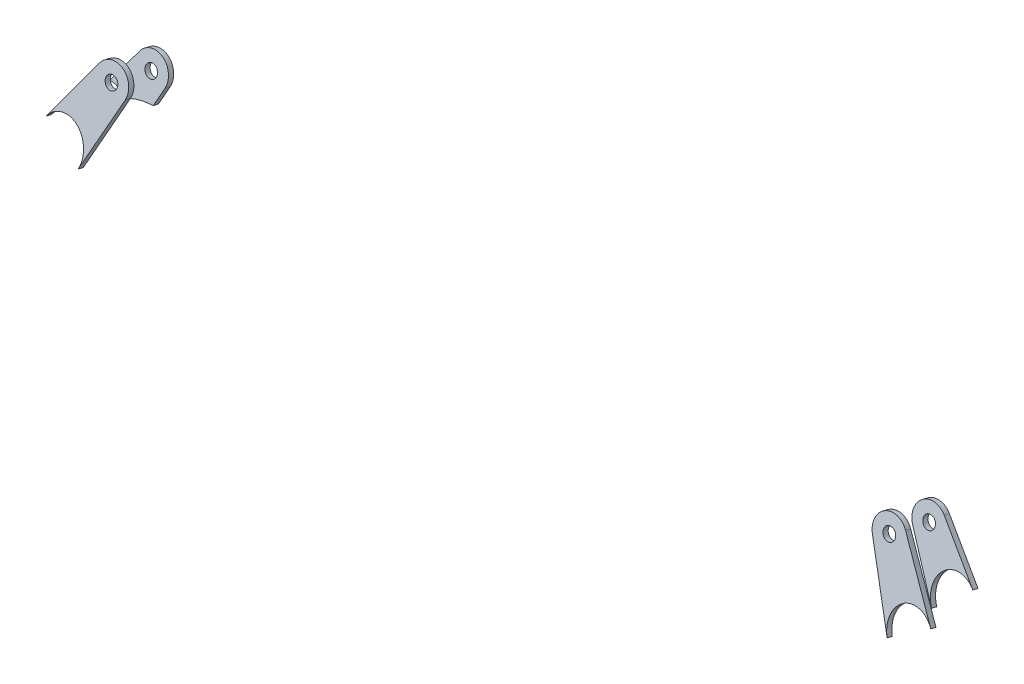
ISO-10303-21;
HEADER;
FILE_DESCRIPTION(('STEP AP214'),'2;1');
FILE_NAME('part.step','',(''),(''),'','','');
FILE_SCHEMA(('AUTOMOTIVE_DESIGN { 1 0 10303 214 1 1 1 1 }'));
ENDSEC;
DATA;
#1=APPLICATION_CONTEXT('core data for automotive mechanical design processes');
#2=APPLICATION_PROTOCOL_DEFINITION('international standard','automotive_design',2000,#1);
#3=PRODUCT_CONTEXT('',#1,'mechanical');
#4=PRODUCT('Part','Part','',(#3));
#5=PRODUCT_RELATED_PRODUCT_CATEGORY('part','',(#4));
#6=PRODUCT_DEFINITION_FORMATION('','',#4);
#7=PRODUCT_DEFINITION_CONTEXT('part definition',#1,'design');
#8=PRODUCT_DEFINITION('design','',#6,#7);
#9=PRODUCT_DEFINITION_SHAPE('','',#8);
#10=(LENGTH_UNIT() NAMED_UNIT(*) SI_UNIT(.MILLI.,.METRE.));
#11=(NAMED_UNIT(*) PLANE_ANGLE_UNIT() SI_UNIT($,.RADIAN.));
#12=(NAMED_UNIT(*) SI_UNIT($,.STERADIAN.) SOLID_ANGLE_UNIT());
#13=UNCERTAINTY_MEASURE_WITH_UNIT(LENGTH_MEASURE(1.E-05),#10,'distance_accuracy_value','');
#14=(GEOMETRIC_REPRESENTATION_CONTEXT(3) GLOBAL_UNCERTAINTY_ASSIGNED_CONTEXT((#13)) GLOBAL_UNIT_ASSIGNED_CONTEXT((#10,
#11,#12)) REPRESENTATION_CONTEXT('',''));
#15=CARTESIAN_POINT('',(0.,0.,0.));
#16=DIRECTION('',(0.,0.,1.));
#17=DIRECTION('',(1.,0.,0.));
#18=AXIS2_PLACEMENT_3D('',#15,#16,#17);
#19=CARTESIAN_POINT('',(276.400172342298,125.62511904744,-250.915447619186));
#20=DIRECTION('',(0.835441108676598,0.534681813865597,-0.127096466727488));
#21=DIRECTION('',(-0.539053341897115,0.842271627558208,0.));
#22=AXIS2_PLACEMENT_3D('',#19,#20,#21);
#23=PLANE('',#22);
#24=DIRECTION('',(-0.54956965034393,0.811360603043202,-0.19916619002788));
#25=VECTOR('',#24,1.);
#26=CARTESIAN_POINT('',(276.410280763866,124.916399097279,-253.830514316889));
#27=LINE('',#26,#25);
#28=CARTESIAN_POINT('',(210.174873139271,222.703458916671,-277.834485011557));
#29=VERTEX_POINT('',#28);
#30=CARTESIAN_POINT('',(187.902995793864,255.584684840564,-285.90590044157));
#31=VERTEX_POINT('',#30);
#32=EDGE_CURVE('E130',#29,#31,#27,.T.);
#33=ORIENTED_EDGE('',*,*,#32,.T.);
#34=DIRECTION('',(0.00336947385613183,-0.236239983387161,-0.9716888992343));
#35=VECTOR('',#34,1.);
#36=CARTESIAN_POINT('',(187.892887372296,256.293404790725,-282.990833743867));
#37=LINE('',#36,#35);
#38=CARTESIAN_POINT('',(187.892887372296,256.293404790725,-282.990833743867));
#39=VERTEX_POINT('',#38);
#40=EDGE_CURVE('E131',#39,#31,#37,.T.);
#41=ORIENTED_EDGE('',*,*,#40,.F.);
#42=DIRECTION('',(-0.54956965034393,0.811360603043202,-0.19916619002788));
#43=VECTOR('',#42,1.);
#44=CARTESIAN_POINT('',(276.400172342298,125.62511904744,-250.915447619186));
#45=LINE('',#44,#43);
#46=CARTESIAN_POINT('',(210.164764717702,223.412178866832,-274.919418313854));
#47=VERTEX_POINT('',#46);
#48=EDGE_CURVE('E108',#47,#39,#45,.T.);
#49=ORIENTED_EDGE('',*,*,#48,.F.);
#50=DIRECTION('',(0.00336947385613183,-0.236239983387161,-0.9716888992343));
#51=VECTOR('',#50,1.);
#52=CARTESIAN_POINT('',(210.164764717702,223.412178866832,-274.919418313854));
#53=LINE('',#52,#51);
#54=EDGE_CURVE('E12',#47,#29,#53,.T.);
#55=ORIENTED_EDGE('',*,*,#54,.T.);
#56=EDGE_LOOP('',(#33,#41,#49,#55));
#57=FACE_BOUND('',#56,.T.);
#58=ADVANCED_FACE('F50',(#57),#23,.T.);
#59=CARTESIAN_POINT('',(199.892236479848,228.936466831874,-276.298121634924));
#60=CARTESIAN_POINT('',(174.893160796666,228.724378984754,-276.333246151102));
#61=CARTESIAN_POINT('',(175.108137508272,202.321573672781,-269.913369736336));
#62=CARTESIAN_POINT('',(200.107213191454,202.533661519902,-269.878245220158));
#63=CARTESIAN_POINT('',(225.106288874636,202.745749367022,-269.843120703979));
#64=CARTESIAN_POINT('',(224.89131216303,229.148554678995,-276.262997118745));
#65=CARTESIAN_POINT('',(199.892236479848,228.936466831874,-276.298121634924));
#66=(BOUNDED_CURVE() B_SPLINE_CURVE(3,(#59,#60,#61,#62,#63,#64,#65),.UNSPECIFIED.,.T.,
.F.) B_SPLINE_CURVE_WITH_KNOTS((4,3,4),(0.,0.5,1.),
.UNSPECIFIED.) CURVE() GEOMETRIC_REPRESENTATION_ITEM() RATIONAL_B_SPLINE_CURVE((1.,
0.333333333333333,0.333333333333333,1.,0.333333333333333,0.333333333333333,1.)) REPRESENTATION_ITEM(''));
#67=DIRECTION('',(0.00336947385613183,-0.236239983387161,-0.9716888992343));
#68=VECTOR('',#67,1.);
#69=SURFACE_OF_LINEAR_EXTRUSION('',#66,#68);
#70=CARTESIAN_POINT('',(199.902344901417,228.227746881713,-279.213188332627));
#71=CARTESIAN_POINT('',(174.903269218234,228.015659034592,-279.248312848805));
#72=CARTESIAN_POINT('',(175.11824592984,201.61285372262,-272.828436434039));
#73=CARTESIAN_POINT('',(200.117321613023,201.82494156974,-272.793311917861));
#74=CARTESIAN_POINT('',(225.116397296205,202.037029416861,-272.758187401682));
#75=CARTESIAN_POINT('',(224.901420584599,228.439834728833,-279.178063816448));
#76=CARTESIAN_POINT('',(199.902344901417,228.227746881713,-279.213188332627));
#77=(BOUNDED_CURVE() B_SPLINE_CURVE(3,(#70,#71,#72,#73,#74,#75,#76),.UNSPECIFIED.,.T.,
.F.) B_SPLINE_CURVE_WITH_KNOTS((4,3,4),(0.,0.5,1.),
.UNSPECIFIED.) CURVE() GEOMETRIC_REPRESENTATION_ITEM() RATIONAL_B_SPLINE_CURVE((1.,
0.333333333333333,0.333333333333333,1.,0.333333333333333,0.333333333333333,1.)) REPRESENTATION_ITEM(''));
#78=CARTESIAN_POINT('',(188.796839764339,209.198501147152,-274.625249754243));
#79=VERTEX_POINT('',#78);
#80=EDGE_CURVE('E132',#29,#79,#77,.T.);
#81=ORIENTED_EDGE('',*,*,#80,.F.);
#82=ORIENTED_EDGE('',*,*,#54,.F.);
#83=CARTESIAN_POINT('',(188.78673134277,209.907221097314,-271.71018305654));
#84=VERTEX_POINT('',#83);
#85=EDGE_CURVE('E92',#47,#84,#66,.T.);
#86=ORIENTED_EDGE('',*,*,#85,.T.);
#87=DIRECTION('',(0.00336947385613183,-0.236239983387161,-0.9716888992343));
#88=VECTOR('',#87,1.);
#89=CARTESIAN_POINT('',(188.78673134277,209.907221097314,-271.71018305654));
#90=LINE('',#89,#88);
#91=EDGE_CURVE('E59',#84,#79,#90,.T.);
#92=ORIENTED_EDGE('',*,*,#91,.T.);
#93=EDGE_LOOP('',(#81,#82,#86,#92));
#94=FACE_BOUND('',#93,.T.);
#95=ADVANCED_FACE('F106',(#94),#69,.T.);
#96=CARTESIAN_POINT('',(257.55574981966,62.4466030390152,-235.620638967011));
#97=DIRECTION('',(-0.910894605273247,-0.401673091284917,0.0944973323523765));
#98=DIRECTION('',(0.40347861175709,-0.914989076358058,0.));
#99=AXIS2_PLACEMENT_3D('',#96,#97,#98);
#100=PLANE('',#99);
#101=DIRECTION('',(0.412625332147736,-0.884787770025588,0.216543153397003));
#102=VECTOR('',#101,1.);
#103=CARTESIAN_POINT('',(257.565858241229,61.7378830888537,-238.535705664713));
#104=LINE('',#103,#102);
#105=CARTESIAN_POINT('',(171.31280651134,246.689313241634,-283.800759350311));
#106=VERTEX_POINT('',#105);
#107=EDGE_CURVE('E102',#106,#79,#104,.T.);
#108=ORIENTED_EDGE('',*,*,#107,.T.);
#109=ORIENTED_EDGE('',*,*,#91,.F.);
#110=DIRECTION('',(0.412625332147736,-0.884787770025588,0.216543153397003));
#111=VECTOR('',#110,1.);
#112=CARTESIAN_POINT('',(257.55574981966,62.4466030390152,-235.620638967011));
#113=LINE('',#112,#111);
#114=CARTESIAN_POINT('',(171.302698089772,247.398033191795,-280.885692652608));
#115=VERTEX_POINT('',#114);
#116=EDGE_CURVE('E95',#115,#84,#113,.T.);
#117=ORIENTED_EDGE('',*,*,#116,.F.);
#118=DIRECTION('',(0.00336947385613183,-0.236239983387161,-0.9716888992343));
#119=VECTOR('',#118,1.);
#120=CARTESIAN_POINT('',(171.302698089772,247.398033191795,-280.885692652608));
#121=LINE('',#120,#119);
#122=EDGE_CURVE('E105',#115,#106,#121,.T.);
#123=ORIENTED_EDGE('',*,*,#122,.T.);
#124=EDGE_LOOP('',(#108,#109,#117,#123));
#125=FACE_BOUND('',#124,.T.);
#126=ADVANCED_FACE('F101',(#125),#100,.T.);
#127=CARTESIAN_POINT('',(179.956196839868,251.213927559002,-281.783417309956));
#128=DIRECTION('',(0.00336947385613183,-0.236239983387161,-0.9716888992343));
#129=DIRECTION('',(0.,-0.971694415245328,0.236241324456668));
#130=AXIS2_PLACEMENT_3D('',#127,#128,#129);
#131=CYLINDRICAL_SURFACE('',#130,3.50000000000002);
#132=CARTESIAN_POINT('',(179.956196839868,251.213927559002,-281.783417309956));
#133=DIRECTION('',(0.00336947385613193,-0.236239983387161,-0.971688899234301));
#134=DIRECTION('',(0.,0.971694415245328,-0.236241324456668));
#135=AXIS2_PLACEMENT_3D('',#132,#133,#134);
#136=CIRCLE('',#135,3.50000000000002);
#137=CARTESIAN_POINT('',(179.956196839868,254.614858012361,-282.610261945554));
#138=VERTEX_POINT('',#137);
#139=EDGE_CURVE('E110',#138,#138,#136,.T.);
#140=ORIENTED_EDGE('',*,*,#139,.F.);
#141=EDGE_LOOP('',(#140));
#142=FACE_BOUND('',#141,.T.);
#143=CARTESIAN_POINT('',(179.966305261436,250.50520760884,-284.698484007659));
#144=DIRECTION('',(0.00336947385613193,-0.236239983387161,-0.971688899234301));
#145=DIRECTION('',(0.,0.971694415245328,-0.236241324456668));
#146=AXIS2_PLACEMENT_3D('',#143,#144,#145);
#147=CIRCLE('',#146,3.50000000000002);
#148=CARTESIAN_POINT('',(179.966305261436,253.906138062199,-285.525328643257));
#149=VERTEX_POINT('',#148);
#150=EDGE_CURVE('E133',#149,#149,#147,.T.);
#151=ORIENTED_EDGE('',*,*,#150,.T.);
#152=EDGE_LOOP('',(#151));
#153=FACE_BOUND('',#152,.T.);
#154=ADVANCED_FACE('F52',(#142,#153),#131,.F.);
#155=CARTESIAN_POINT('',(179.956196839868,251.213927559002,-281.783417309956));
#156=DIRECTION('',(0.00336947385613183,-0.236239983387161,-0.9716888992343));
#157=DIRECTION('',(0.,-0.971694415245328,0.236241324456668));
#158=AXIS2_PLACEMENT_3D('',#155,#156,#157);
#159=CYLINDRICAL_SURFACE('',#158,9.50000000000004);
#160=CARTESIAN_POINT('',(179.966305261436,250.50520760884,-284.698484007659));
#161=DIRECTION('',(0.00336947385613193,-0.236239983387161,-0.971688899234301));
#162=DIRECTION('',(0.,0.971694415245328,-0.236241324456668));
#163=AXIS2_PLACEMENT_3D('',#160,#161,#162);
#164=CIRCLE('',#163,9.50000000000004);
#165=EDGE_CURVE('E81',#106,#31,#164,.T.);
#166=ORIENTED_EDGE('',*,*,#165,.F.);
#167=ORIENTED_EDGE('',*,*,#122,.F.);
#168=CARTESIAN_POINT('',(179.956196839868,251.213927559002,-281.783417309956));
#169=DIRECTION('',(0.00336947385613193,-0.236239983387161,-0.971688899234301));
#170=DIRECTION('',(0.,0.971694415245328,-0.236241324456668));
#171=AXIS2_PLACEMENT_3D('',#168,#169,#170);
#172=CIRCLE('',#171,9.50000000000004);
#173=EDGE_CURVE('E67',#115,#39,#172,.T.);
#174=ORIENTED_EDGE('',*,*,#173,.T.);
#175=ORIENTED_EDGE('',*,*,#40,.T.);
#176=EDGE_LOOP('',(#166,#167,#174,#175));
#177=FACE_BOUND('',#176,.T.);
#178=ADVANCED_FACE('F154',(#177),#159,.T.);
#179=CARTESIAN_POINT('',(0.724657250124397,-50.807047046597,-208.976663942384));
#180=DIRECTION('',(-0.00336947385613193,0.236239983387161,0.971688899234301));
#181=DIRECTION('',(0.,0.971694415245328,-0.236241324456668));
#182=AXIS2_PLACEMENT_3D('',#179,#180,#181);
#183=PLANE('',#182);
#184=ORIENTED_EDGE('',*,*,#139,.T.);
#185=EDGE_LOOP('',(#184));
#186=FACE_BOUND('',#185,.T.);
#187=ORIENTED_EDGE('',*,*,#48,.T.);
#188=ORIENTED_EDGE('',*,*,#173,.F.);
#189=ORIENTED_EDGE('',*,*,#116,.T.);
#190=ORIENTED_EDGE('',*,*,#85,.F.);
#191=EDGE_LOOP('',(#187,#188,#189,#190));
#192=FACE_BOUND('',#191,.T.);
#193=ADVANCED_FACE('F97',(#186,#192),#183,.T.);
#194=CARTESIAN_POINT('',(0.734765671692793,-51.5157669967584,-211.891730640087));
#195=DIRECTION('',(-0.00336947385613193,0.236239983387161,0.971688899234301));
#196=DIRECTION('',(0.,0.971694415245328,-0.236241324456668));
#197=AXIS2_PLACEMENT_3D('',#194,#195,#196);
#198=PLANE('',#197);
#199=ORIENTED_EDGE('',*,*,#150,.F.);
#200=EDGE_LOOP('',(#199));
#201=FACE_BOUND('',#200,.T.);
#202=ORIENTED_EDGE('',*,*,#32,.F.);
#203=ORIENTED_EDGE('',*,*,#80,.T.);
#204=ORIENTED_EDGE('',*,*,#107,.F.);
#205=ORIENTED_EDGE('',*,*,#165,.T.);
#206=EDGE_LOOP('',(#202,#203,#204,#205));
#207=FACE_BOUND('',#206,.T.);
#208=ADVANCED_FACE('F147',(#201,#207),#198,.F.);
#209=CLOSED_SHELL('',(#58,#95,#126,#154,#178,#193,#208));
#210=MANIFOLD_SOLID_BREP('B2',#209);
#211=CARTESIAN_POINT('',(-323.696250842742,90.0681750723665,-244.351656831913));
#212=DIRECTION('',(-0.912699556866031,0.396326961653705,-0.0995211453053768));
#213=DIRECTION('',(-0.398304364611704,-0.917253309141628,0.));
#214=AXIS2_PLACEMENT_3D('',#211,#212,#213);
#215=PLANE('',#214);
#216=DIRECTION('',(-0.408617382819777,-0.887195361640026,0.214280714815728));
#217=VECTOR('',#216,1.);
#218=CARTESIAN_POINT('',(-323.686142421174,89.359455122205,-247.266723529616));
#219=LINE('',#218,#217);
#220=CARTESIAN_POINT('',(-251.363048948382,246.388293752936,-285.19326512726));
#221=VERTEX_POINT('',#220);
#222=CARTESIAN_POINT('',(-268.758725154767,208.618575939186,-276.070897629127));
#223=VERTEX_POINT('',#222);
#224=EDGE_CURVE('E296',#221,#223,#219,.T.);
#225=ORIENTED_EDGE('',*,*,#224,.F.);
#226=DIRECTION('',(0.00336947385613183,-0.236239983387161,-0.9716888992343));
#227=VECTOR('',#226,1.);
#228=CARTESIAN_POINT('',(-251.373157369951,247.097013703098,-282.278198429557));
#229=LINE('',#228,#227);
#230=CARTESIAN_POINT('',(-251.373157369951,247.097013703098,-282.278198429557));
#231=VERTEX_POINT('',#230);
#232=EDGE_CURVE('E297',#231,#221,#229,.T.);
#233=ORIENTED_EDGE('',*,*,#232,.F.);
#234=DIRECTION('',(-0.408617382819777,-0.887195361640026,0.214280714815728));
#235=VECTOR('',#234,1.);
#236=CARTESIAN_POINT('',(-323.696250842742,90.0681750723665,-244.351656831913));
#237=LINE('',#236,#235);
#238=CARTESIAN_POINT('',(-268.768833576335,209.327295889347,-273.155830931424));
#239=VERTEX_POINT('',#238);
#240=EDGE_CURVE('E274',#231,#239,#237,.T.);
#241=ORIENTED_EDGE('',*,*,#240,.T.);
#242=DIRECTION('',(0.00336947385613183,-0.236239983387161,-0.9716888992343));
#243=VECTOR('',#242,1.);
#244=CARTESIAN_POINT('',(-268.768833576335,209.327295889347,-273.155830931424));
#245=LINE('',#244,#243);
#246=EDGE_CURVE('E48',#239,#223,#245,.T.);
#247=ORIENTED_EDGE('',*,*,#246,.T.);
#248=EDGE_LOOP('',(#225,#233,#241,#247));
#249=FACE_BOUND('',#248,.T.);
#250=ADVANCED_FACE('F216',(#249),#215,.F.);
#251=CARTESIAN_POINT('',(-279.902620065767,201.906150500386,-271.390187357377));
#252=CARTESIAN_POINT('',(-254.903544382585,202.118238347506,-271.355062841199));
#253=CARTESIAN_POINT('',(-255.118521094191,228.521043659479,-277.774939255965));
#254=CARTESIAN_POINT('',(-280.117596777373,228.308955812358,-277.810063772143));
#255=CARTESIAN_POINT('',(-305.116672460555,228.096867965238,-277.845188288322));
#256=CARTESIAN_POINT('',(-304.901695748949,201.694062653265,-271.425311873556));
#257=CARTESIAN_POINT('',(-279.902620065767,201.906150500386,-271.390187357377));
#258=(BOUNDED_CURVE() B_SPLINE_CURVE(3,(#251,#252,#253,#254,#255,#256,#257),.UNSPECIFIED.,.T.,
.F.) B_SPLINE_CURVE_WITH_KNOTS((4,3,4),(0.,0.5,1.),
.UNSPECIFIED.) CURVE() GEOMETRIC_REPRESENTATION_ITEM() RATIONAL_B_SPLINE_CURVE((1.,
0.333333333333333,0.333333333333333,1.,0.333333333333333,0.333333333333333,1.)) REPRESENTATION_ITEM(''));
#259=DIRECTION('',(0.00336947385613183,-0.236239983387161,-0.9716888992343));
#260=VECTOR('',#259,1.);
#261=SURFACE_OF_LINEAR_EXTRUSION('',#258,#260);
#262=CARTESIAN_POINT('',(-279.892511644198,201.197430550224,-274.30525405508));
#263=CARTESIAN_POINT('',(-254.893435961016,201.409518397344,-274.270129538901));
#264=CARTESIAN_POINT('',(-255.108412672622,227.812323709317,-280.690005953668));
#265=CARTESIAN_POINT('',(-280.107488355804,227.600235862197,-280.725130469846));
#266=CARTESIAN_POINT('',(-305.106564038987,227.388148015076,-280.760254986025));
#267=CARTESIAN_POINT('',(-304.891587327381,200.985342703104,-274.340378571258));
#268=CARTESIAN_POINT('',(-279.892511644198,201.197430550224,-274.30525405508));
#269=(BOUNDED_CURVE() B_SPLINE_CURVE(3,(#262,#263,#264,#265,#266,#267,#268),.UNSPECIFIED.,.T.,
.F.) B_SPLINE_CURVE_WITH_KNOTS((4,3,4),(0.,0.5,1.),
.UNSPECIFIED.) CURVE() GEOMETRIC_REPRESENTATION_ITEM() RATIONAL_B_SPLINE_CURVE((1.,
0.333333333333333,0.333333333333333,1.,0.333333333333333,0.333333333333333,1.)) REPRESENTATION_ITEM(''));
#270=CARTESIAN_POINT('',(-290.205687124664,222.027794972094,-279.405358547404));
#271=VERTEX_POINT('',#270);
#272=EDGE_CURVE('E298',#223,#271,#269,.T.);
#273=ORIENTED_EDGE('',*,*,#272,.F.);
#274=ORIENTED_EDGE('',*,*,#246,.F.);
#275=CARTESIAN_POINT('',(-290.215795546232,222.736514922256,-276.490291849701));
#276=VERTEX_POINT('',#275);
#277=EDGE_CURVE('E258',#239,#276,#258,.T.);
#278=ORIENTED_EDGE('',*,*,#277,.T.);
#279=DIRECTION('',(0.00336947385613183,-0.236239983387161,-0.9716888992343));
#280=VECTOR('',#279,1.);
#281=CARTESIAN_POINT('',(-290.215795546232,222.736514922256,-276.490291849701));
#282=LINE('',#281,#280);
#283=EDGE_CURVE('E225',#276,#271,#282,.T.);
#284=ORIENTED_EDGE('',*,*,#283,.T.);
#285=EDGE_LOOP('',(#273,#274,#278,#284));
#286=FACE_BOUND('',#285,.T.);
#287=ADVANCED_FACE('F272',(#286),#261,.T.);
#288=CARTESIAN_POINT('',(-332.409547729097,159.750126482613,-261.32316106809));
#289=DIRECTION('',(-0.837949841349879,0.529625440788603,-0.131669874501309));
#290=DIRECTION('',(-0.534277059055671,-0.845309425102325,0.));
#291=AXIS2_PLACEMENT_3D('',#288,#289,#290);
#292=PLANE('',#291);
#293=DIRECTION('',(-0.545736850531138,-0.814670217154593,0.19617269752349));
#294=VECTOR('',#293,1.);
#295=CARTESIAN_POINT('',(-332.399439307528,159.041406532452,-264.238227765793));
#296=LINE('',#295,#294);
#297=CARTESIAN_POINT('',(-267.994218231401,255.184841576124,-287.38957981542));
#298=VERTEX_POINT('',#297);
#299=EDGE_CURVE('E268',#298,#271,#296,.T.);
#300=ORIENTED_EDGE('',*,*,#299,.T.);
#301=ORIENTED_EDGE('',*,*,#283,.F.);
#302=DIRECTION('',(-0.545736850531138,-0.814670217154593,0.19617269752349));
#303=VECTOR('',#302,1.);
#304=CARTESIAN_POINT('',(-332.409547729097,159.750126482613,-261.32316106809));
#305=LINE('',#304,#303);
#306=CARTESIAN_POINT('',(-268.004326652969,255.893561526285,-284.474513117717));
#307=VERTEX_POINT('',#306);
#308=EDGE_CURVE('E261',#307,#276,#305,.T.);
#309=ORIENTED_EDGE('',*,*,#308,.F.);
#310=DIRECTION('',(0.00336947385613183,-0.236239983387161,-0.9716888992343));
#311=VECTOR('',#310,1.);
#312=CARTESIAN_POINT('',(-268.004326652969,255.893561526285,-284.474513117717));
#313=LINE('',#312,#311);
#314=EDGE_CURVE('E271',#307,#298,#313,.T.);
#315=ORIENTED_EDGE('',*,*,#314,.T.);
#316=EDGE_LOOP('',(#300,#301,#309,#315));
#317=FACE_BOUND('',#316,.T.);
#318=ADVANCED_FACE('F267',(#317),#292,.T.);
#319=CARTESIAN_POINT('',(-260.043803160145,250.862119838793,-283.223649309954));
#320=DIRECTION('',(0.00336947385613183,-0.236239983387161,-0.9716888992343));
#321=DIRECTION('',(0.,-0.971694415245328,0.236241324456668));
#322=AXIS2_PLACEMENT_3D('',#319,#320,#321);
#323=CYLINDRICAL_SURFACE('',#322,3.50000000000007);
#324=CARTESIAN_POINT('',(-260.043803160145,250.862119838793,-283.223649309954));
#325=DIRECTION('',(0.00336947385613193,-0.236239983387161,-0.971688899234301));
#326=DIRECTION('',(0.,0.971694415245328,-0.236241324456668));
#327=AXIS2_PLACEMENT_3D('',#324,#325,#326);
#328=CIRCLE('',#327,3.50000000000007);
#329=CARTESIAN_POINT('',(-260.043803160145,254.263050292152,-284.050493945553));
#330=VERTEX_POINT('',#329);
#331=EDGE_CURVE('E276',#330,#330,#328,.T.);
#332=ORIENTED_EDGE('',*,*,#331,.F.);
#333=EDGE_LOOP('',(#332));
#334=FACE_BOUND('',#333,.T.);
#335=CARTESIAN_POINT('',(-260.033694738576,250.153399888632,-286.138716007657));
#336=DIRECTION('',(0.00336947385613193,-0.236239983387161,-0.971688899234301));
#337=DIRECTION('',(0.,0.971694415245328,-0.236241324456668));
#338=AXIS2_PLACEMENT_3D('',#335,#336,#337);
#339=CIRCLE('',#338,3.50000000000007);
#340=CARTESIAN_POINT('',(-260.033694738576,253.554330341991,-286.965560643255));
#341=VERTEX_POINT('',#340);
#342=EDGE_CURVE('E299',#341,#341,#339,.T.);
#343=ORIENTED_EDGE('',*,*,#342,.T.);
#344=EDGE_LOOP('',(#343));
#345=FACE_BOUND('',#344,.T.);
#346=ADVANCED_FACE('F218',(#334,#345),#323,.F.);
#347=CARTESIAN_POINT('',(-260.043803160145,250.862119838793,-283.223649309954));
#348=DIRECTION('',(0.00336947385613183,-0.236239983387161,-0.9716888992343));
#349=DIRECTION('',(0.,-0.971694415245328,0.236241324456668));
#350=AXIS2_PLACEMENT_3D('',#347,#348,#349);
#351=CYLINDRICAL_SURFACE('',#350,9.49999999998205);
#352=CARTESIAN_POINT('',(-260.033694738576,250.153399888632,-286.138716007657));
#353=DIRECTION('',(0.00336947385613193,-0.236239983387161,-0.971688899234301));
#354=DIRECTION('',(0.,0.971694415245328,-0.236241324456668));
#355=AXIS2_PLACEMENT_3D('',#352,#353,#354);
#356=CIRCLE('',#355,9.49999999998205);
#357=EDGE_CURVE('E247',#298,#221,#356,.T.);
#358=ORIENTED_EDGE('',*,*,#357,.F.);
#359=ORIENTED_EDGE('',*,*,#314,.F.);
#360=CARTESIAN_POINT('',(-260.043803160145,250.862119838793,-283.223649309954));
#361=DIRECTION('',(0.00336947385613193,-0.236239983387161,-0.971688899234301));
#362=DIRECTION('',(0.,0.971694415245328,-0.236241324456668));
#363=AXIS2_PLACEMENT_3D('',#360,#361,#362);
#364=CIRCLE('',#363,9.49999999998205);
#365=EDGE_CURVE('E233',#307,#231,#364,.T.);
#366=ORIENTED_EDGE('',*,*,#365,.T.);
#367=ORIENTED_EDGE('',*,*,#232,.T.);
#368=EDGE_LOOP('',(#358,#359,#366,#367));
#369=FACE_BOUND('',#368,.T.);
#370=ADVANCED_FACE('F320',(#369),#351,.T.);
#371=CARTESIAN_POINT('',(0.724657250124397,-50.807047046597,-208.976663942384));
#372=DIRECTION('',(-0.00336947385613193,0.236239983387161,0.971688899234301));
#373=DIRECTION('',(0.,0.971694415245328,-0.236241324456668));
#374=AXIS2_PLACEMENT_3D('',#371,#372,#373);
#375=PLANE('',#374);
#376=ORIENTED_EDGE('',*,*,#331,.T.);
#377=EDGE_LOOP('',(#376));
#378=FACE_BOUND('',#377,.T.);
#379=ORIENTED_EDGE('',*,*,#240,.F.);
#380=ORIENTED_EDGE('',*,*,#365,.F.);
#381=ORIENTED_EDGE('',*,*,#308,.T.);
#382=ORIENTED_EDGE('',*,*,#277,.F.);
#383=EDGE_LOOP('',(#379,#380,#381,#382));
#384=FACE_BOUND('',#383,.T.);
#385=ADVANCED_FACE('F263',(#378,#384),#375,.T.);
#386=CARTESIAN_POINT('',(0.734765671692793,-51.5157669967584,-211.891730640087));
#387=DIRECTION('',(-0.00336947385613193,0.236239983387161,0.971688899234301));
#388=DIRECTION('',(0.,0.971694415245328,-0.236241324456668));
#389=AXIS2_PLACEMENT_3D('',#386,#387,#388);
#390=PLANE('',#389);
#391=ORIENTED_EDGE('',*,*,#342,.F.);
#392=EDGE_LOOP('',(#391));
#393=FACE_BOUND('',#392,.T.);
#394=ORIENTED_EDGE('',*,*,#224,.T.);
#395=ORIENTED_EDGE('',*,*,#272,.T.);
#396=ORIENTED_EDGE('',*,*,#299,.F.);
#397=ORIENTED_EDGE('',*,*,#357,.T.);
#398=EDGE_LOOP('',(#394,#395,#396,#397));
#399=FACE_BOUND('',#398,.T.);
#400=ADVANCED_FACE('F313',(#393,#399),#390,.F.);
#401=CLOSED_SHELL('',(#250,#287,#318,#346,#370,#385,#400));
#402=MANIFOLD_SOLID_BREP('B6',#401);
#403=CARTESIAN_POINT('',(259.189959811541,176.321590448709,-286.97073542829));
#404=DIRECTION('',(-0.733932457577158,-0.660576514949453,0.158056368463876));
#405=DIRECTION('',(0.668985603179699,-0.743275361315236,0.));
#406=AXIS2_PLACEMENT_3D('',#403,#404,#405);
#407=PLANE('',#406);
#408=DIRECTION('',(0.679214100531406,-0.712621455014139,0.175609986882423));
#409=VECTOR('',#408,1.);
#410=CARTESIAN_POINT('',(259.20006823311,175.612870498547,-289.885802125993));
#411=LINE('',#410,#409);
#412=CARTESIAN_POINT('',(187.01616150711,251.347164882955,-308.548864190454));
#413=VERTEX_POINT('',#412);
#414=CARTESIAN_POINT('',(208.816866377583,228.474185636831,-302.912318227501));
#415=VERTEX_POINT('',#414);
#416=EDGE_CURVE('E461',#413,#415,#411,.T.);
#417=ORIENTED_EDGE('',*,*,#416,.F.);
#418=DIRECTION('',(0.00336947385613183,-0.236239983387161,-0.9716888992343));
#419=VECTOR('',#418,1.);
#420=CARTESIAN_POINT('',(187.006053085542,252.055884833117,-305.633797492752));
#421=LINE('',#420,#419);
#422=CARTESIAN_POINT('',(187.006053085542,252.055884833117,-305.633797492752));
#423=VERTEX_POINT('',#422);
#424=EDGE_CURVE('E462',#423,#413,#421,.T.);
#425=ORIENTED_EDGE('',*,*,#424,.F.);
#426=DIRECTION('',(0.679214100531406,-0.712621455014139,0.175609986882423));
#427=VECTOR('',#426,1.);
#428=CARTESIAN_POINT('',(259.189959811541,176.321590448709,-286.97073542829));
#429=LINE('',#428,#427);
#430=CARTESIAN_POINT('',(208.806757956015,229.182905586992,-299.997251529798));
#431=VERTEX_POINT('',#430);
#432=EDGE_CURVE('E439',#423,#431,#429,.T.);
#433=ORIENTED_EDGE('',*,*,#432,.T.);
#434=DIRECTION('',(0.00336947385613183,-0.236239983387161,-0.9716888992343));
#435=VECTOR('',#434,1.);
#436=CARTESIAN_POINT('',(208.806757956015,229.182905586992,-299.997251529798));
#437=LINE('',#436,#435);
#438=EDGE_CURVE('E214',#431,#415,#437,.T.);
#439=ORIENTED_EDGE('',*,*,#438,.T.);
#440=EDGE_LOOP('',(#417,#425,#433,#439));
#441=FACE_BOUND('',#440,.T.);
#442=ADVANCED_FACE('F381',(#441),#407,.F.);
#443=CARTESIAN_POINT('',(199.892236479848,233.02101043087,-300.961295754599));
#444=CARTESIAN_POINT('',(174.893160796666,232.808922583749,-300.996420270777));
#445=CARTESIAN_POINT('',(175.108137508272,206.406117271777,-294.576543856011));
#446=CARTESIAN_POINT('',(200.107213191454,206.618205118897,-294.541419339833));
#447=CARTESIAN_POINT('',(225.106288874636,206.830292966017,-294.506294823654));
#448=CARTESIAN_POINT('',(224.89131216303,233.23309827799,-300.92617123842));
#449=CARTESIAN_POINT('',(199.892236479848,233.02101043087,-300.961295754599));
#450=(BOUNDED_CURVE() B_SPLINE_CURVE(3,(#443,#444,#445,#446,#447,#448,#449),.UNSPECIFIED.,.T.,
.F.) B_SPLINE_CURVE_WITH_KNOTS((4,3,4),(0.,0.5,1.),
.UNSPECIFIED.) CURVE() GEOMETRIC_REPRESENTATION_ITEM() RATIONAL_B_SPLINE_CURVE((1.,
0.333333333333333,0.333333333333333,1.,0.333333333333333,0.333333333333333,1.)) REPRESENTATION_ITEM(''));
#451=DIRECTION('',(0.00336947385613183,-0.236239983387161,-0.9716888992343));
#452=VECTOR('',#451,1.);
#453=SURFACE_OF_LINEAR_EXTRUSION('',#450,#452);
#454=CARTESIAN_POINT('',(199.902344901417,232.312290480708,-303.876362452302));
#455=CARTESIAN_POINT('',(174.903269218234,232.100202633588,-303.91148696848));
#456=CARTESIAN_POINT('',(175.11824592984,205.697397321615,-297.491610553714));
#457=CARTESIAN_POINT('',(200.117321613023,205.909485168736,-297.456486037536));
#458=CARTESIAN_POINT('',(225.116397296205,206.121573015856,-297.421361521357));
#459=CARTESIAN_POINT('',(224.901420584599,232.524378327828,-303.841237936123));
#460=CARTESIAN_POINT('',(199.902344901417,232.312290480708,-303.876362452302));
#461=(BOUNDED_CURVE() B_SPLINE_CURVE(3,(#454,#455,#456,#457,#458,#459,#460),.UNSPECIFIED.,.T.,
.F.) B_SPLINE_CURVE_WITH_KNOTS((4,3,4),(0.,0.5,1.),
.UNSPECIFIED.) CURVE() GEOMETRIC_REPRESENTATION_ITEM() RATIONAL_B_SPLINE_CURVE((1.,
0.333333333333333,0.333333333333333,1.,0.333333333333333,0.333333333333333,1.)) REPRESENTATION_ITEM(''));
#462=CARTESIAN_POINT('',(189.558411513671,211.87519909172,-298.943503261594));
#463=VERTEX_POINT('',#462);
#464=EDGE_CURVE('E463',#415,#463,#461,.T.);
#465=ORIENTED_EDGE('',*,*,#464,.F.);
#466=ORIENTED_EDGE('',*,*,#438,.F.);
#467=CARTESIAN_POINT('',(189.548303092102,212.583919041882,-296.028436563891));
#468=VERTEX_POINT('',#467);
#469=EDGE_CURVE('E423',#431,#468,#450,.T.);
#470=ORIENTED_EDGE('',*,*,#469,.T.);
#471=DIRECTION('',(0.00336947385613183,-0.236239983387161,-0.9716888992343));
#472=VECTOR('',#471,1.);
#473=CARTESIAN_POINT('',(189.548303092102,212.583919041882,-296.028436563891));
#474=LINE('',#473,#472);
#475=EDGE_CURVE('E390',#468,#463,#474,.T.);
#476=ORIENTED_EDGE('',*,*,#475,.T.);
#477=EDGE_LOOP('',(#465,#466,#470,#476));
#478=FACE_BOUND('',#477,.T.);
#479=ADVANCED_FACE('F437',(#478),#453,.T.);
#480=CARTESIAN_POINT('',(261.486445654151,96.7358160243039,-267.613634619888));
#481=DIRECTION('',(-0.856315479423987,-0.502508395226948,0.119201981633294));
#482=DIRECTION('',(0.506116996496215,-0.862464831664254,0.));
#483=AXIS2_PLACEMENT_3D('',#480,#481,#482);
#484=PLANE('',#483);
#485=DIRECTION('',(0.516442103574834,-0.831670597638074,0.203989143533496));
#486=VECTOR('',#485,1.);
#487=CARTESIAN_POINT('',(261.496554075719,96.0270960741424,-270.528701317591));
#488=LINE('',#487,#486);
#489=CARTESIAN_POINT('',(171.908806105599,240.29785823628,-305.914909864531));
#490=VERTEX_POINT('',#489);
#491=EDGE_CURVE('E433',#490,#463,#488,.T.);
#492=ORIENTED_EDGE('',*,*,#491,.T.);
#493=ORIENTED_EDGE('',*,*,#475,.F.);
#494=DIRECTION('',(0.516442103574834,-0.831670597638074,0.203989143533496));
#495=VECTOR('',#494,1.);
#496=CARTESIAN_POINT('',(261.486445654151,96.7358160243039,-267.613634619888));
#497=LINE('',#496,#495);
#498=CARTESIAN_POINT('',(171.898697684031,241.006578186441,-302.999843166828));
#499=VERTEX_POINT('',#498);
#500=EDGE_CURVE('E426',#499,#468,#497,.T.);
#501=ORIENTED_EDGE('',*,*,#500,.F.);
#502=DIRECTION('',(0.00336947385613183,-0.236239983387161,-0.9716888992343));
#503=VECTOR('',#502,1.);
#504=CARTESIAN_POINT('',(171.898697684031,241.006578186441,-302.999843166828));
#505=LINE('',#504,#503);
#506=EDGE_CURVE('E436',#499,#490,#505,.T.);
#507=ORIENTED_EDGE('',*,*,#506,.T.);
#508=EDGE_LOOP('',(#492,#493,#501,#507));
#509=FACE_BOUND('',#508,.T.);
#510=ADVANCED_FACE('F432',(#509),#484,.T.);
#511=CARTESIAN_POINT('',(180.033694738559,245.780407941097,-304.132261992345));
#512=DIRECTION('',(0.00336947385613183,-0.236239983387161,-0.9716888992343));
#513=DIRECTION('',(0.,-0.971694415245328,0.236241324456668));
#514=AXIS2_PLACEMENT_3D('',#511,#512,#513);
#515=CYLINDRICAL_SURFACE('',#514,3.5);
#516=CARTESIAN_POINT('',(180.033694738559,245.780407941097,-304.132261992345));
#517=DIRECTION('',(0.00336947385613179,-0.236239983387161,-0.971688899234301));
#518=DIRECTION('',(0.,0.971694415245328,-0.236241324456668));
#519=AXIS2_PLACEMENT_3D('',#516,#517,#518);
#520=CIRCLE('',#519,3.5);
#521=CARTESIAN_POINT('',(180.033694738559,249.181338394456,-304.959106627943));
#522=VERTEX_POINT('',#521);
#523=EDGE_CURVE('E441',#522,#522,#520,.T.);
#524=ORIENTED_EDGE('',*,*,#523,.F.);
#525=EDGE_LOOP('',(#524));
#526=FACE_BOUND('',#525,.T.);
#527=CARTESIAN_POINT('',(180.043803160127,245.071687990936,-307.047328690048));
#528=DIRECTION('',(0.00336947385613179,-0.236239983387161,-0.971688899234301));
#529=DIRECTION('',(0.,0.971694415245328,-0.236241324456668));
#530=AXIS2_PLACEMENT_3D('',#527,#528,#529);
#531=CIRCLE('',#530,3.5);
#532=CARTESIAN_POINT('',(180.043803160127,248.472618444294,-307.874173325646));
#533=VERTEX_POINT('',#532);
#534=EDGE_CURVE('E464',#533,#533,#531,.T.);
#535=ORIENTED_EDGE('',*,*,#534,.T.);
#536=EDGE_LOOP('',(#535));
#537=FACE_BOUND('',#536,.T.);
#538=ADVANCED_FACE('F383',(#526,#537),#515,.F.);
#539=CARTESIAN_POINT('',(180.033694738559,245.780407941097,-304.132261992345));
#540=DIRECTION('',(0.00336947385613183,-0.236239983387161,-0.9716888992343));
#541=DIRECTION('',(0.,-0.971694415245328,0.236241324456668));
#542=AXIS2_PLACEMENT_3D('',#539,#540,#541);
#543=CYLINDRICAL_SURFACE('',#542,9.49999999999997);
#544=CARTESIAN_POINT('',(180.043803160127,245.071687990936,-307.047328690048));
#545=DIRECTION('',(0.00336947385613179,-0.236239983387161,-0.971688899234301));
#546=DIRECTION('',(0.,0.971694415245328,-0.236241324456668));
#547=AXIS2_PLACEMENT_3D('',#544,#545,#546);
#548=CIRCLE('',#547,9.49999999999997);
#549=EDGE_CURVE('E412',#490,#413,#548,.T.);
#550=ORIENTED_EDGE('',*,*,#549,.F.);
#551=ORIENTED_EDGE('',*,*,#506,.F.);
#552=CARTESIAN_POINT('',(180.033694738559,245.780407941097,-304.132261992345));
#553=DIRECTION('',(0.00336947385613179,-0.236239983387161,-0.971688899234301));
#554=DIRECTION('',(0.,0.971694415245328,-0.236241324456668));
#555=AXIS2_PLACEMENT_3D('',#552,#553,#554);
#556=CIRCLE('',#555,9.49999999999997);
#557=EDGE_CURVE('E398',#499,#423,#556,.T.);
#558=ORIENTED_EDGE('',*,*,#557,.T.);
#559=ORIENTED_EDGE('',*,*,#424,.T.);
#560=EDGE_LOOP('',(#550,#551,#558,#559));
#561=FACE_BOUND('',#560,.T.);
#562=ADVANCED_FACE('F485',(#561),#543,.T.);
#563=CARTESIAN_POINT('',(0.802155148815398,-56.2405666645017,-231.325508624773));
#564=DIRECTION('',(-0.00336947385613179,0.236239983387161,0.971688899234301));
#565=DIRECTION('',(0.,0.971694415245328,-0.236241324456668));
#566=AXIS2_PLACEMENT_3D('',#563,#564,#565);
#567=PLANE('',#566);
#568=ORIENTED_EDGE('',*,*,#523,.T.);
#569=EDGE_LOOP('',(#568));
#570=FACE_BOUND('',#569,.T.);
#571=ORIENTED_EDGE('',*,*,#432,.F.);
#572=ORIENTED_EDGE('',*,*,#557,.F.);
#573=ORIENTED_EDGE('',*,*,#500,.T.);
#574=ORIENTED_EDGE('',*,*,#469,.F.);
#575=EDGE_LOOP('',(#571,#572,#573,#574));
#576=FACE_BOUND('',#575,.T.);
#577=ADVANCED_FACE('F428',(#570,#576),#567,.T.);
#578=CARTESIAN_POINT('',(0.812263570383794,-56.9492866146632,-234.240575322476));
#579=DIRECTION('',(-0.00336947385613179,0.236239983387161,0.971688899234301));
#580=DIRECTION('',(0.,0.971694415245328,-0.236241324456668));
#581=AXIS2_PLACEMENT_3D('',#578,#579,#580);
#582=PLANE('',#581);
#583=ORIENTED_EDGE('',*,*,#534,.F.);
#584=EDGE_LOOP('',(#583));
#585=FACE_BOUND('',#584,.T.);
#586=ORIENTED_EDGE('',*,*,#416,.T.);
#587=ORIENTED_EDGE('',*,*,#464,.T.);
#588=ORIENTED_EDGE('',*,*,#491,.F.);
#589=ORIENTED_EDGE('',*,*,#549,.T.);
#590=EDGE_LOOP('',(#586,#587,#588,#589));
#591=FACE_BOUND('',#590,.T.);
#592=ADVANCED_FACE('F478',(#585,#591),#582,.F.);
#593=CLOSED_SHELL('',(#442,#479,#510,#538,#562,#577,#592));
#594=MANIFOLD_SOLID_BREP('B42',#593);
#595=CARTESIAN_POINT('',(-323.618752944074,84.6346554557861,-266.700501514624));
#596=DIRECTION('',(0.912699556864611,-0.396326961656786,0.0995211453061209));
#597=DIRECTION('',(0.39830436461483,0.91725330914027,0.));
#598=AXIS2_PLACEMENT_3D('',#595,#596,#597);
#599=PLANE('',#598);
#600=DIRECTION('',(0.408617382822947,0.88719536163865,-0.214280714815382));
#601=VECTOR('',#600,1.);
#602=CARTESIAN_POINT('',(-323.608644522506,83.9259355056246,-269.615568212327));
#603=LINE('',#602,#601);
#604=CARTESIAN_POINT('',(-255.599003551994,231.589350113446,-305.280116746263));
#605=VERTEX_POINT('',#604);
#606=CARTESIAN_POINT('',(-251.285551049671,240.954774134988,-307.542109809638));
#607=VERTEX_POINT('',#606);
#608=EDGE_CURVE('E634',#605,#607,#603,.T.);
#609=ORIENTED_EDGE('',*,*,#608,.T.);
#610=DIRECTION('',(0.00336947385613183,-0.236239983387161,-0.9716888992343));
#611=VECTOR('',#610,1.);
#612=CARTESIAN_POINT('',(-251.29565947124,241.663494085149,-304.627043111935));
#613=LINE('',#612,#611);
#614=CARTESIAN_POINT('',(-251.29565947124,241.663494085149,-304.627043111935));
#615=VERTEX_POINT('',#614);
#616=EDGE_CURVE('E636',#615,#607,#613,.T.);
#617=ORIENTED_EDGE('',*,*,#616,.F.);
#618=DIRECTION('',(0.408617382822947,0.88719536163865,-0.214280714815382));
#619=VECTOR('',#618,1.);
#620=CARTESIAN_POINT('',(-323.618752944074,84.6346554557861,-266.700501514624));
#621=LINE('',#620,#619);
#622=CARTESIAN_POINT('',(-255.609111973563,232.298070063608,-302.36505004856));
#623=VERTEX_POINT('',#622);
#624=EDGE_CURVE('E607',#623,#615,#621,.T.);
#625=ORIENTED_EDGE('',*,*,#624,.F.);
#626=DIRECTION('',(0.00336947385613183,-0.236239983387161,-0.9716888992343));
#627=VECTOR('',#626,1.);
#628=CARTESIAN_POINT('',(-255.609111973563,232.298070063608,-302.36505004856));
#629=LINE('',#628,#627);
#630=EDGE_CURVE('E379',#623,#605,#629,.T.);
#631=ORIENTED_EDGE('',*,*,#630,.T.);
#632=EDGE_LOOP('',(#609,#617,#625,#631));
#633=FACE_BOUND('',#632,.T.);
#634=ADVANCED_FACE('F537',(#633),#599,.T.);
#635=CARTESIAN_POINT('',(-267.768306548203,216.515355784536,-298.57007197094));
#636=CARTESIAN_POINT('',(-244.725102094374,199.337784130967,-294.313902408543));
#637=CARTESIAN_POINT('',(-204.568474804515,198.7676940574,-294.03605136432));
#638=CARTESIAN_POINT('',(-208.929507414764,215.680041227753,-298.162955564922));
#639=CARTESIAN_POINT('',(-213.290540025014,232.592388398106,-302.289859765523));
#640=CARTESIAN_POINT('',(-255.476061824664,241.030653600877,-304.487681152403));
#641=CARTESIAN_POINT('',(-270.741108911879,228.044062431943,-301.383275094755));
#642=(BOUNDED_CURVE() B_SPLINE_CURVE(3,(#635,#636,#637,#638,#639,#640,#641),.UNSPECIFIED.,.F.,
.F.) B_SPLINE_CURVE_WITH_KNOTS((4,3,4),(0.,0.5,1.),
.UNSPECIFIED.) CURVE() GEOMETRIC_REPRESENTATION_ITEM() RATIONAL_B_SPLINE_CURVE((1.,
0.48841086436143,0.48841086436143,1.,0.48841086436143,0.48841086436143,1.)) REPRESENTATION_ITEM(''));
#643=DIRECTION('',(0.00336947385613183,-0.236239983387161,-0.9716888992343));
#644=VECTOR('',#643,1.);
#645=SURFACE_OF_LINEAR_EXTRUSION('',#642,#644);
#646=CARTESIAN_POINT('',(-267.758198126635,215.806635834375,-301.485138668643));
#647=CARTESIAN_POINT('',(-244.714993672805,198.629064180805,-297.228969106246));
#648=CARTESIAN_POINT('',(-204.558366382947,198.058974107238,-296.951118062023));
#649=CARTESIAN_POINT('',(-208.919398993196,214.971321277591,-301.078022262625));
#650=CARTESIAN_POINT('',(-213.280431603445,231.883668447944,-305.204926463226));
#651=CARTESIAN_POINT('',(-255.465953403095,240.321933650716,-307.402747850106));
#652=CARTESIAN_POINT('',(-270.731000490311,227.335342481781,-304.298341792458));
#653=(BOUNDED_CURVE() B_SPLINE_CURVE(3,(#646,#647,#648,#649,#650,#651,#652),.UNSPECIFIED.,.F.,
.F.) B_SPLINE_CURVE_WITH_KNOTS((4,3,4),(0.,0.5,1.),
.UNSPECIFIED.) CURVE() GEOMETRIC_REPRESENTATION_ITEM() RATIONAL_B_SPLINE_CURVE((1.,
0.48841086436143,0.48841086436143,1.,0.48841086436143,0.48841086436143,1.)) REPRESENTATION_ITEM(''));
#654=CARTESIAN_POINT('',(-270.731000490313,227.335342481788,-304.298341792459));
#655=VERTEX_POINT('',#654);
#656=EDGE_CURVE('E638',#605,#655,#653,.T.);
#657=ORIENTED_EDGE('',*,*,#656,.F.);
#658=ORIENTED_EDGE('',*,*,#630,.F.);
#659=CARTESIAN_POINT('',(-270.741108911881,228.044062431949,-301.383275094756));
#660=VERTEX_POINT('',#659);
#661=EDGE_CURVE('E583',#623,#660,#642,.T.);
#662=ORIENTED_EDGE('',*,*,#661,.T.);
#663=DIRECTION('',(0.00336947385613183,-0.236239983387161,-0.9716888992343));
#664=VECTOR('',#663,1.);
#665=CARTESIAN_POINT('',(-270.741108911881,228.044062431949,-301.383275094756));
#666=LINE('',#665,#664);
#667=EDGE_CURVE('E546',#660,#655,#666,.T.);
#668=ORIENTED_EDGE('',*,*,#667,.T.);
#669=EDGE_LOOP('',(#657,#658,#662,#668));
#670=FACE_BOUND('',#669,.T.);
#671=ADVANCED_FACE('F624',(#670),#645,.T.);
#672=CARTESIAN_POINT('',(-270.741108911881,228.044062431949,-301.383275094756));
#673=CARTESIAN_POINT('',(-275.397420952184,233.48199443561,-302.721508235956));
#674=CARTESIAN_POINT('',(-282.313406535008,234.096347828351,-302.894853910728));
#675=CARTESIAN_POINT('',(-287.759062855812,229.555783012878,-301.809821488515));
#676=(BOUNDED_CURVE() B_SPLINE_CURVE(3,(#672,#673,#674,#675),.UNSPECIFIED.,.F.,
.F.) B_SPLINE_CURVE_WITH_KNOTS((4,4),(0.,1.),
.UNSPECIFIED.) CURVE() GEOMETRIC_REPRESENTATION_ITEM() RATIONAL_B_SPLINE_CURVE((1.,
0.820223126076394,0.820223126076394,1.)) REPRESENTATION_ITEM(''));
#677=DIRECTION('',(0.00336947385613183,-0.236239983387161,-0.9716888992343));
#678=VECTOR('',#677,1.);
#679=SURFACE_OF_LINEAR_EXTRUSION('',#676,#678);
#680=CARTESIAN_POINT('',(-270.731000490313,227.335342481788,-304.298341792459));
#681=CARTESIAN_POINT('',(-275.387312530615,232.773274485448,-305.636574933659));
#682=CARTESIAN_POINT('',(-282.30329811344,233.387627878189,-305.80992060843));
#683=CARTESIAN_POINT('',(-287.748954434244,228.847063062717,-304.724888186218));
#684=(BOUNDED_CURVE() B_SPLINE_CURVE(3,(#680,#681,#682,#683),.UNSPECIFIED.,.F.,
.F.) B_SPLINE_CURVE_WITH_KNOTS((4,4),(0.,1.),
.UNSPECIFIED.) CURVE() GEOMETRIC_REPRESENTATION_ITEM() RATIONAL_B_SPLINE_CURVE((1.,
0.820223126076394,0.820223126076394,1.)) REPRESENTATION_ITEM(''));
#685=CARTESIAN_POINT('',(-280.018977938609,231.685199389689,-305.388099760963));
#686=VERTEX_POINT('',#685);
#687=EDGE_CURVE('E641',#655,#686,#684,.T.);
#688=ORIENTED_EDGE('',*,*,#687,.F.);
#689=ORIENTED_EDGE('',*,*,#667,.F.);
#690=CARTESIAN_POINT('',(-280.029086360177,232.393919339851,-302.473033063261));
#691=VERTEX_POINT('',#690);
#692=EDGE_CURVE('E592',#660,#691,#676,.T.);
#693=ORIENTED_EDGE('',*,*,#692,.T.);
#694=DIRECTION('',(0.00336947385613183,-0.236239983387161,-0.9716888992343));
#695=VECTOR('',#694,1.);
#696=CARTESIAN_POINT('',(-280.029086360177,232.393919339851,-302.473033063261));
#697=LINE('',#696,#695);
#698=EDGE_CURVE('E597',#691,#686,#697,.T.);
#699=ORIENTED_EDGE('',*,*,#698,.T.);
#700=EDGE_LOOP('',(#688,#689,#693,#699));
#701=FACE_BOUND('',#700,.T.);
#702=ADVANCED_FACE('F604',(#701),#679,.T.);
#703=CARTESIAN_POINT('',(-332.332049830405,154.316606864709,-283.672005750479));
#704=DIRECTION('',(0.837949841349879,-0.529625440788603,0.131669874501309));
#705=DIRECTION('',(0.534277059055671,0.845309425102325,0.));
#706=AXIS2_PLACEMENT_3D('',#703,#704,#705);
#707=PLANE('',#706);
#708=DIRECTION('',(0.545736850531138,0.814670217154593,-0.19617269752349));
#709=VECTOR('',#708,1.);
#710=CARTESIAN_POINT('',(-332.321941408837,153.607886914547,-286.587072448182));
#711=LINE('',#710,#709);
#712=CARTESIAN_POINT('',(-267.916720332709,249.751321958219,-309.738424497809));
#713=VERTEX_POINT('',#712);
#714=EDGE_CURVE('E599',#686,#713,#711,.T.);
#715=ORIENTED_EDGE('',*,*,#714,.F.);
#716=ORIENTED_EDGE('',*,*,#698,.F.);
#717=DIRECTION('',(0.545736850531138,0.814670217154593,-0.19617269752349));
#718=VECTOR('',#717,1.);
#719=CARTESIAN_POINT('',(-332.332049830405,154.316606864709,-283.672005750479));
#720=LINE('',#719,#718);
#721=CARTESIAN_POINT('',(-267.926828754278,250.460041908381,-306.823357800106));
#722=VERTEX_POINT('',#721);
#723=EDGE_CURVE('E588',#691,#722,#720,.T.);
#724=ORIENTED_EDGE('',*,*,#723,.T.);
#725=DIRECTION('',(0.00336947385613183,-0.236239983387161,-0.9716888992343));
#726=VECTOR('',#725,1.);
#727=CARTESIAN_POINT('',(-267.926828754278,250.460041908381,-306.823357800106));
#728=LINE('',#727,#726);
#729=EDGE_CURVE('E602',#722,#713,#728,.T.);
#730=ORIENTED_EDGE('',*,*,#729,.T.);
#731=EDGE_LOOP('',(#715,#716,#724,#730));
#732=FACE_BOUND('',#731,.T.);
#733=ADVANCED_FACE('F598',(#732),#707,.F.);
#734=CARTESIAN_POINT('',(-259.966305261454,245.428600220889,-305.572493992343));
#735=DIRECTION('',(0.00336947385613183,-0.236239983387161,-0.9716888992343));
#736=DIRECTION('',(0.,-0.971694415245328,0.236241324456668));
#737=AXIS2_PLACEMENT_3D('',#734,#735,#736);
#738=CYLINDRICAL_SURFACE('',#737,3.50000000000014);
#739=CARTESIAN_POINT('',(-259.966305261454,245.428600220889,-305.572493992343));
#740=DIRECTION('',(0.00336947385613179,-0.236239983387161,-0.971688899234301));
#741=DIRECTION('',(0.,0.971694415245328,-0.236241324456668));
#742=AXIS2_PLACEMENT_3D('',#739,#740,#741);
#743=CIRCLE('',#742,3.50000000000014);
#744=CARTESIAN_POINT('',(-259.966305261454,248.829530674247,-306.399338627942));
#745=VERTEX_POINT('',#744);
#746=EDGE_CURVE('E659',#745,#745,#743,.T.);
#747=ORIENTED_EDGE('',*,*,#746,.F.);
#748=EDGE_LOOP('',(#747));
#749=FACE_BOUND('',#748,.T.);
#750=CARTESIAN_POINT('',(-259.956196839885,244.719880270727,-308.487560690046));
#751=DIRECTION('',(0.00336947385613179,-0.236239983387161,-0.971688899234301));
#752=DIRECTION('',(0.,0.971694415245328,-0.236241324456668));
#753=AXIS2_PLACEMENT_3D('',#750,#751,#752);
#754=CIRCLE('',#753,3.50000000000014);
#755=CARTESIAN_POINT('',(-259.956196839885,248.120810724086,-309.314405325644));
#756=VERTEX_POINT('',#755);
#757=EDGE_CURVE('E639',#756,#756,#754,.T.);
#758=ORIENTED_EDGE('',*,*,#757,.T.);
#759=EDGE_LOOP('',(#758));
#760=FACE_BOUND('',#759,.T.);
#761=ADVANCED_FACE('F539',(#749,#760),#738,.F.);
#762=CARTESIAN_POINT('',(-259.966305261454,245.428600220889,-305.572493992343));
#763=DIRECTION('',(0.00336947385613183,-0.236239983387161,-0.9716888992343));
#764=DIRECTION('',(0.,-0.971694415245328,0.236241324456668));
#765=AXIS2_PLACEMENT_3D('',#762,#763,#764);
#766=CYLINDRICAL_SURFACE('',#765,9.50000000000008);
#767=CARTESIAN_POINT('',(-259.956196839885,244.719880270727,-308.487560690046));
#768=DIRECTION('',(0.00336947385613179,-0.236239983387161,-0.971688899234301));
#769=DIRECTION('',(0.,0.971694415245328,-0.236241324456668));
#770=AXIS2_PLACEMENT_3D('',#767,#768,#769);
#771=CIRCLE('',#770,9.50000000000008);
#772=EDGE_CURVE('E571',#713,#607,#771,.T.);
#773=ORIENTED_EDGE('',*,*,#772,.F.);
#774=ORIENTED_EDGE('',*,*,#729,.F.);
#775=CARTESIAN_POINT('',(-259.966305261454,245.428600220889,-305.572493992343));
#776=DIRECTION('',(0.00336947385613179,-0.236239983387161,-0.971688899234301));
#777=DIRECTION('',(0.,0.971694415245328,-0.236241324456668));
#778=AXIS2_PLACEMENT_3D('',#775,#776,#777);
#779=CIRCLE('',#778,9.50000000000008);
#780=EDGE_CURVE('E554',#722,#615,#779,.T.);
#781=ORIENTED_EDGE('',*,*,#780,.T.);
#782=ORIENTED_EDGE('',*,*,#616,.T.);
#783=EDGE_LOOP('',(#773,#774,#781,#782));
#784=FACE_BOUND('',#783,.T.);
#785=ADVANCED_FACE('F668',(#784),#766,.T.);
#786=CARTESIAN_POINT('',(0.802155148815398,-56.2405666645017,-231.325508624773));
#787=DIRECTION('',(-0.00336947385613179,0.236239983387161,0.971688899234301));
#788=DIRECTION('',(0.,0.971694415245328,-0.236241324456668));
#789=AXIS2_PLACEMENT_3D('',#786,#787,#788);
#790=PLANE('',#789);
#791=ORIENTED_EDGE('',*,*,#746,.T.);
#792=EDGE_LOOP('',(#791));
#793=FACE_BOUND('',#792,.T.);
#794=ORIENTED_EDGE('',*,*,#624,.T.);
#795=ORIENTED_EDGE('',*,*,#780,.F.);
#796=ORIENTED_EDGE('',*,*,#723,.F.);
#797=ORIENTED_EDGE('',*,*,#692,.F.);
#798=ORIENTED_EDGE('',*,*,#661,.F.);
#799=EDGE_LOOP('',(#794,#795,#796,#797,#798));
#800=FACE_BOUND('',#799,.T.);
#801=ADVANCED_FACE('F590',(#793,#800),#790,.T.);
#802=CARTESIAN_POINT('',(0.812263570383794,-56.9492866146632,-234.240575322476));
#803=DIRECTION('',(-0.00336947385613179,0.236239983387161,0.971688899234301));
#804=DIRECTION('',(0.,0.971694415245328,-0.236241324456668));
#805=AXIS2_PLACEMENT_3D('',#802,#803,#804);
#806=PLANE('',#805);
#807=ORIENTED_EDGE('',*,*,#757,.F.);
#808=EDGE_LOOP('',(#807));
#809=FACE_BOUND('',#808,.T.);
#810=ORIENTED_EDGE('',*,*,#608,.F.);
#811=ORIENTED_EDGE('',*,*,#656,.T.);
#812=ORIENTED_EDGE('',*,*,#687,.T.);
#813=ORIENTED_EDGE('',*,*,#714,.T.);
#814=ORIENTED_EDGE('',*,*,#772,.T.);
#815=EDGE_LOOP('',(#810,#811,#812,#813,#814));
#816=FACE_BOUND('',#815,.T.);
#817=ADVANCED_FACE('F661',(#809,#816),#806,.F.);
#818=CLOSED_SHELL('',(#634,#671,#702,#733,#761,#785,#801,#817));
#819=MANIFOLD_SOLID_BREP('B208',#818);
#820=ADVANCED_BREP_SHAPE_REPRESENTATION('',(#18,#210,#402,#594,#819),#14);
#821=SHAPE_DEFINITION_REPRESENTATION(#9,#820);
ENDSEC;
END-ISO-10303-21;
